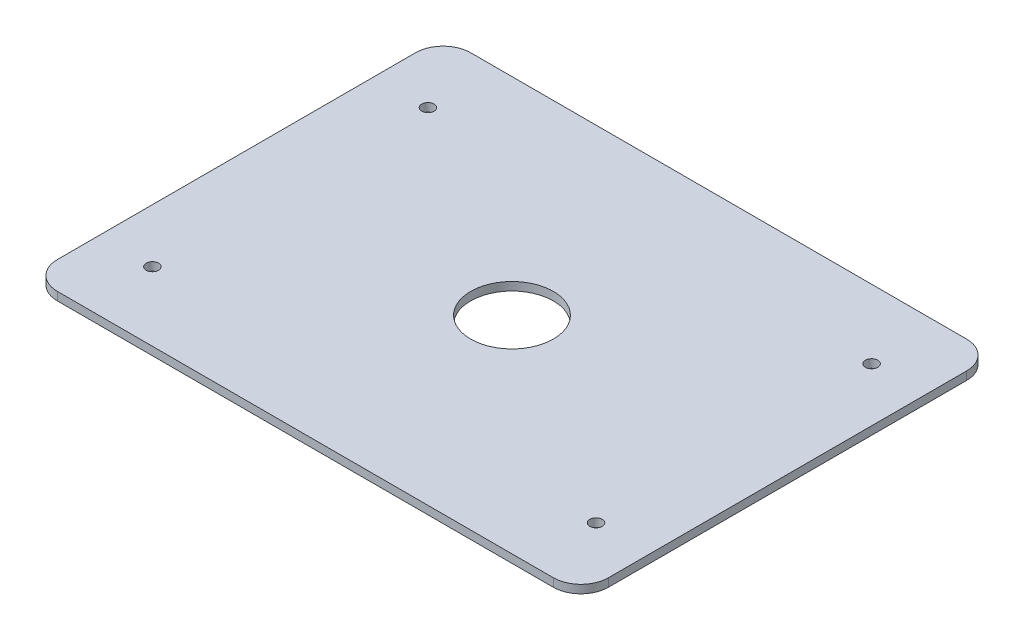
ISO-10303-21;
HEADER;
FILE_DESCRIPTION(('STEP AP214'),'2;1');
FILE_NAME('part.step','',(''),(''),'','','');
FILE_SCHEMA(('AUTOMOTIVE_DESIGN { 1 0 10303 214 1 1 1 1 }'));
ENDSEC;
DATA;
#1=APPLICATION_CONTEXT('core data for automotive mechanical design processes');
#2=APPLICATION_PROTOCOL_DEFINITION('international standard','automotive_design',2000,#1);
#3=PRODUCT_CONTEXT('',#1,'mechanical');
#4=PRODUCT('Part','Part','',(#3));
#5=PRODUCT_RELATED_PRODUCT_CATEGORY('part','',(#4));
#6=PRODUCT_DEFINITION_FORMATION('','',#4);
#7=PRODUCT_DEFINITION_CONTEXT('part definition',#1,'design');
#8=PRODUCT_DEFINITION('design','',#6,#7);
#9=PRODUCT_DEFINITION_SHAPE('','',#8);
#10=(LENGTH_UNIT() NAMED_UNIT(*) SI_UNIT(.MILLI.,.METRE.));
#11=(NAMED_UNIT(*) PLANE_ANGLE_UNIT() SI_UNIT($,.RADIAN.));
#12=(NAMED_UNIT(*) SI_UNIT($,.STERADIAN.) SOLID_ANGLE_UNIT());
#13=UNCERTAINTY_MEASURE_WITH_UNIT(LENGTH_MEASURE(1.E-05),#10,'distance_accuracy_value','');
#14=(GEOMETRIC_REPRESENTATION_CONTEXT(3) GLOBAL_UNCERTAINTY_ASSIGNED_CONTEXT((#13)) GLOBAL_UNIT_ASSIGNED_CONTEXT((#10,
#11,#12)) REPRESENTATION_CONTEXT('',''));
#15=CARTESIAN_POINT('',(0.,0.,0.));
#16=DIRECTION('',(0.,0.,1.));
#17=DIRECTION('',(1.,0.,0.));
#18=AXIS2_PLACEMENT_3D('',#15,#16,#17);
#19=CARTESIAN_POINT('',(145.2,3.,0.));
#20=DIRECTION('',(1.,0.,0.));
#21=DIRECTION('',(0.,0.,-1.));
#22=AXIS2_PLACEMENT_3D('',#19,#20,#21);
#23=PLANE('',#22);
#24=DIRECTION('',(0.,0.,1.));
#25=VECTOR('',#24,1.);
#26=CARTESIAN_POINT('',(145.2,0.,0.));
#27=LINE('',#26,#25);
#28=CARTESIAN_POINT('',(145.2,0.,70.43));
#29=VERTEX_POINT('',#28);
#30=CARTESIAN_POINT('',(145.2,0.,200.43));
#31=VERTEX_POINT('',#30);
#32=EDGE_CURVE('E129',#29,#31,#27,.T.);
#33=ORIENTED_EDGE('',*,*,#32,.F.);
#34=DIRECTION('',(0.,-1.,0.));
#35=VECTOR('',#34,1.);
#36=CARTESIAN_POINT('',(145.2,3.,70.43));
#37=LINE('',#36,#35);
#38=CARTESIAN_POINT('',(145.2,3.,70.43));
#39=VERTEX_POINT('',#38);
#40=EDGE_CURVE('E152',#29,#39,#37,.F.);
#41=ORIENTED_EDGE('',*,*,#40,.T.);
#42=DIRECTION('',(0.,0.,1.));
#43=VECTOR('',#42,1.);
#44=CARTESIAN_POINT('',(145.2,3.,0.));
#45=LINE('',#44,#43);
#46=CARTESIAN_POINT('',(145.2,3.,200.43));
#47=VERTEX_POINT('',#46);
#48=EDGE_CURVE('E167',#39,#47,#45,.T.);
#49=ORIENTED_EDGE('',*,*,#48,.T.);
#50=DIRECTION('',(0.,-1.,0.));
#51=VECTOR('',#50,1.);
#52=CARTESIAN_POINT('',(145.2,0.,200.43));
#53=LINE('',#52,#51);
#54=EDGE_CURVE('E149',#47,#31,#53,.T.);
#55=ORIENTED_EDGE('',*,*,#54,.T.);
#56=EDGE_LOOP('',(#33,#41,#49,#55));
#57=FACE_BOUND('',#56,.T.);
#58=ADVANCED_FACE('F34',(#57),#23,.T.);
#59=CARTESIAN_POINT('',(0.,3.,60.43));
#60=DIRECTION('',(0.,0.,-1.));
#61=DIRECTION('',(-1.,0.,0.));
#62=AXIS2_PLACEMENT_3D('',#59,#60,#61);
#63=PLANE('',#62);
#64=DIRECTION('',(1.,0.,0.));
#65=VECTOR('',#64,1.);
#66=CARTESIAN_POINT('',(0.,0.,60.43));
#67=LINE('',#66,#65);
#68=CARTESIAN_POINT('',(-44.8,0.,60.43));
#69=VERTEX_POINT('',#68);
#70=CARTESIAN_POINT('',(135.2,0.,60.43));
#71=VERTEX_POINT('',#70);
#72=EDGE_CURVE('E125',#69,#71,#67,.T.);
#73=ORIENTED_EDGE('',*,*,#72,.F.);
#74=DIRECTION('',(0.,-1.,0.));
#75=VECTOR('',#74,1.);
#76=CARTESIAN_POINT('',(-44.8,3.,60.43));
#77=LINE('',#76,#75);
#78=CARTESIAN_POINT('',(-44.8,3.,60.43));
#79=VERTEX_POINT('',#78);
#80=EDGE_CURVE('E104',#69,#79,#77,.F.);
#81=ORIENTED_EDGE('',*,*,#80,.T.);
#82=DIRECTION('',(1.,0.,0.));
#83=VECTOR('',#82,1.);
#84=CARTESIAN_POINT('',(0.,3.,60.43));
#85=LINE('',#84,#83);
#86=CARTESIAN_POINT('',(135.2,3.,60.43));
#87=VERTEX_POINT('',#86);
#88=EDGE_CURVE('E169',#79,#87,#85,.T.);
#89=ORIENTED_EDGE('',*,*,#88,.T.);
#90=DIRECTION('',(0.,-1.,0.));
#91=VECTOR('',#90,1.);
#92=CARTESIAN_POINT('',(135.2,3.,60.43));
#93=LINE('',#92,#91);
#94=EDGE_CURVE('E109',#87,#71,#93,.T.);
#95=ORIENTED_EDGE('',*,*,#94,.T.);
#96=EDGE_LOOP('',(#73,#81,#89,#95));
#97=FACE_BOUND('',#96,.T.);
#98=ADVANCED_FACE('F210',(#97),#63,.T.);
#99=CARTESIAN_POINT('',(-54.8,3.,0.));
#100=DIRECTION('',(1.,0.,0.));
#101=DIRECTION('',(0.,0.,-1.));
#102=AXIS2_PLACEMENT_3D('',#99,#100,#101);
#103=PLANE('',#102);
#104=DIRECTION('',(0.,0.,1.));
#105=VECTOR('',#104,1.);
#106=CARTESIAN_POINT('',(-54.8,3.,0.));
#107=LINE('',#106,#105);
#108=CARTESIAN_POINT('',(-54.8,3.,70.43));
#109=VERTEX_POINT('',#108);
#110=CARTESIAN_POINT('',(-54.8,3.,200.43));
#111=VERTEX_POINT('',#110);
#112=EDGE_CURVE('E118',#109,#111,#107,.T.);
#113=ORIENTED_EDGE('',*,*,#112,.F.);
#114=DIRECTION('',(0.,-1.,0.));
#115=VECTOR('',#114,1.);
#116=CARTESIAN_POINT('',(-54.8,0.,70.43));
#117=LINE('',#116,#115);
#118=CARTESIAN_POINT('',(-54.8,0.,70.43));
#119=VERTEX_POINT('',#118);
#120=EDGE_CURVE('E103',#109,#119,#117,.T.);
#121=ORIENTED_EDGE('',*,*,#120,.T.);
#122=DIRECTION('',(0.,0.,1.));
#123=VECTOR('',#122,1.);
#124=CARTESIAN_POINT('',(-54.8,0.,0.));
#125=LINE('',#124,#123);
#126=CARTESIAN_POINT('',(-54.8,0.,200.43));
#127=VERTEX_POINT('',#126);
#128=EDGE_CURVE('E116',#119,#127,#125,.T.);
#129=ORIENTED_EDGE('',*,*,#128,.T.);
#130=DIRECTION('',(0.,-1.,0.));
#131=VECTOR('',#130,1.);
#132=CARTESIAN_POINT('',(-54.8,3.,200.43));
#133=LINE('',#132,#131);
#134=EDGE_CURVE('E120',#127,#111,#133,.F.);
#135=ORIENTED_EDGE('',*,*,#134,.T.);
#136=EDGE_LOOP('',(#113,#121,#129,#135));
#137=FACE_BOUND('',#136,.T.);
#138=ADVANCED_FACE('F115',(#137),#103,.F.);
#139=CARTESIAN_POINT('',(-35.3,3.,85.43));
#140=DIRECTION('',(0.,-1.,0.));
#141=DIRECTION('',(0.,0.,-1.));
#142=AXIS2_PLACEMENT_3D('',#139,#140,#141);
#143=CYLINDRICAL_SURFACE('',#142,2.25);
#144=CARTESIAN_POINT('',(-35.3,3.,85.43));
#145=DIRECTION('',(0.,1.,0.));
#146=DIRECTION('',(0.,0.,1.));
#147=AXIS2_PLACEMENT_3D('',#144,#145,#146);
#148=CIRCLE('',#147,2.25);
#149=CARTESIAN_POINT('',(-35.3,3.,87.68));
#150=VERTEX_POINT('',#149);
#151=EDGE_CURVE('E170',#150,#150,#148,.T.);
#152=ORIENTED_EDGE('',*,*,#151,.T.);
#153=EDGE_LOOP('',(#152));
#154=FACE_BOUND('',#153,.T.);
#155=CARTESIAN_POINT('',(-35.3,0.,85.43));
#156=DIRECTION('',(0.,1.,0.));
#157=DIRECTION('',(0.,0.,1.));
#158=AXIS2_PLACEMENT_3D('',#155,#156,#157);
#159=CIRCLE('',#158,2.25);
#160=CARTESIAN_POINT('',(-35.3,0.,87.68));
#161=VERTEX_POINT('',#160);
#162=EDGE_CURVE('E193',#161,#161,#159,.T.);
#163=ORIENTED_EDGE('',*,*,#162,.F.);
#164=EDGE_LOOP('',(#163));
#165=FACE_BOUND('',#164,.T.);
#166=ADVANCED_FACE('F198',(#154,#165),#143,.F.);
#167=CARTESIAN_POINT('',(125.7,3.,85.43));
#168=DIRECTION('',(0.,-1.,0.));
#169=DIRECTION('',(0.,0.,-1.));
#170=AXIS2_PLACEMENT_3D('',#167,#168,#169);
#171=CYLINDRICAL_SURFACE('',#170,2.25000000000001);
#172=CARTESIAN_POINT('',(125.7,3.,85.43));
#173=DIRECTION('',(0.,1.,0.));
#174=DIRECTION('',(0.,0.,1.));
#175=AXIS2_PLACEMENT_3D('',#172,#173,#174);
#176=CIRCLE('',#175,2.25000000000001);
#177=CARTESIAN_POINT('',(125.7,3.,87.68));
#178=VERTEX_POINT('',#177);
#179=EDGE_CURVE('E175',#178,#178,#176,.T.);
#180=ORIENTED_EDGE('',*,*,#179,.T.);
#181=EDGE_LOOP('',(#180));
#182=FACE_BOUND('',#181,.T.);
#183=CARTESIAN_POINT('',(125.7,0.,85.43));
#184=DIRECTION('',(0.,1.,0.));
#185=DIRECTION('',(0.,0.,1.));
#186=AXIS2_PLACEMENT_3D('',#183,#184,#185);
#187=CIRCLE('',#186,2.25000000000001);
#188=CARTESIAN_POINT('',(125.7,0.,87.68));
#189=VERTEX_POINT('',#188);
#190=EDGE_CURVE('E190',#189,#189,#187,.T.);
#191=ORIENTED_EDGE('',*,*,#190,.F.);
#192=EDGE_LOOP('',(#191));
#193=FACE_BOUND('',#192,.T.);
#194=ADVANCED_FACE('F200',(#182,#193),#171,.F.);
#195=CARTESIAN_POINT('',(125.7,3.,185.43));
#196=DIRECTION('',(0.,-1.,0.));
#197=DIRECTION('',(0.,0.,-1.));
#198=AXIS2_PLACEMENT_3D('',#195,#196,#197);
#199=CYLINDRICAL_SURFACE('',#198,2.25000000000001);
#200=CARTESIAN_POINT('',(125.7,3.,185.43));
#201=DIRECTION('',(0.,1.,0.));
#202=DIRECTION('',(0.,0.,1.));
#203=AXIS2_PLACEMENT_3D('',#200,#201,#202);
#204=CIRCLE('',#203,2.25000000000001);
#205=CARTESIAN_POINT('',(125.7,3.,187.68));
#206=VERTEX_POINT('',#205);
#207=EDGE_CURVE('E241',#206,#206,#204,.T.);
#208=ORIENTED_EDGE('',*,*,#207,.T.);
#209=EDGE_LOOP('',(#208));
#210=FACE_BOUND('',#209,.T.);
#211=CARTESIAN_POINT('',(125.7,0.,185.43));
#212=DIRECTION('',(0.,1.,0.));
#213=DIRECTION('',(0.,0.,1.));
#214=AXIS2_PLACEMENT_3D('',#211,#212,#213);
#215=CIRCLE('',#214,2.25000000000001);
#216=CARTESIAN_POINT('',(125.7,0.,187.68));
#217=VERTEX_POINT('',#216);
#218=EDGE_CURVE('E187',#217,#217,#215,.T.);
#219=ORIENTED_EDGE('',*,*,#218,.F.);
#220=EDGE_LOOP('',(#219));
#221=FACE_BOUND('',#220,.T.);
#222=ADVANCED_FACE('F207',(#210,#221),#199,.F.);
#223=CARTESIAN_POINT('',(-35.2999999999999,3.,185.43));
#224=DIRECTION('',(0.,-1.,0.));
#225=DIRECTION('',(0.,0.,-1.));
#226=AXIS2_PLACEMENT_3D('',#223,#224,#225);
#227=CYLINDRICAL_SURFACE('',#226,2.25);
#228=CARTESIAN_POINT('',(-35.2999999999999,3.,185.43));
#229=DIRECTION('',(0.,1.,0.));
#230=DIRECTION('',(0.,0.,1.));
#231=AXIS2_PLACEMENT_3D('',#228,#229,#230);
#232=CIRCLE('',#231,2.25);
#233=CARTESIAN_POINT('',(-35.2999999999999,3.,187.68));
#234=VERTEX_POINT('',#233);
#235=EDGE_CURVE('E237',#234,#234,#232,.T.);
#236=ORIENTED_EDGE('',*,*,#235,.T.);
#237=EDGE_LOOP('',(#236));
#238=FACE_BOUND('',#237,.T.);
#239=CARTESIAN_POINT('',(-35.2999999999999,0.,185.43));
#240=DIRECTION('',(0.,1.,0.));
#241=DIRECTION('',(0.,0.,1.));
#242=AXIS2_PLACEMENT_3D('',#239,#240,#241);
#243=CIRCLE('',#242,2.25);
#244=CARTESIAN_POINT('',(-35.2999999999999,0.,187.68));
#245=VERTEX_POINT('',#244);
#246=EDGE_CURVE('E184',#245,#245,#243,.T.);
#247=ORIENTED_EDGE('',*,*,#246,.F.);
#248=EDGE_LOOP('',(#247));
#249=FACE_BOUND('',#248,.T.);
#250=ADVANCED_FACE('F260',(#238,#249),#227,.F.);
#251=CARTESIAN_POINT('',(45.2,3.,135.43));
#252=DIRECTION('',(0.,-1.,0.));
#253=DIRECTION('',(0.,0.,-1.));
#254=AXIS2_PLACEMENT_3D('',#251,#252,#253);
#255=CYLINDRICAL_SURFACE('',#254,15.);
#256=CARTESIAN_POINT('',(45.2,3.,135.43));
#257=DIRECTION('',(0.,1.,0.));
#258=DIRECTION('',(0.,0.,1.));
#259=AXIS2_PLACEMENT_3D('',#256,#257,#258);
#260=CIRCLE('',#259,15.);
#261=CARTESIAN_POINT('',(45.2,3.,150.43));
#262=VERTEX_POINT('',#261);
#263=EDGE_CURVE('E127',#262,#262,#260,.T.);
#264=ORIENTED_EDGE('',*,*,#263,.T.);
#265=EDGE_LOOP('',(#264));
#266=FACE_BOUND('',#265,.T.);
#267=CARTESIAN_POINT('',(45.2,0.,135.43));
#268=DIRECTION('',(0.,1.,0.));
#269=DIRECTION('',(0.,0.,1.));
#270=AXIS2_PLACEMENT_3D('',#267,#268,#269);
#271=CIRCLE('',#270,15.);
#272=CARTESIAN_POINT('',(45.2,0.,150.43));
#273=VERTEX_POINT('',#272);
#274=EDGE_CURVE('E181',#273,#273,#271,.T.);
#275=ORIENTED_EDGE('',*,*,#274,.F.);
#276=EDGE_LOOP('',(#275));
#277=FACE_BOUND('',#276,.T.);
#278=ADVANCED_FACE('F223',(#266,#277),#255,.F.);
#279=CARTESIAN_POINT('',(0.,3.,210.43));
#280=DIRECTION('',(0.,0.,-1.));
#281=DIRECTION('',(-1.,0.,0.));
#282=AXIS2_PLACEMENT_3D('',#279,#280,#281);
#283=PLANE('',#282);
#284=DIRECTION('',(1.,0.,0.));
#285=VECTOR('',#284,1.);
#286=CARTESIAN_POINT('',(0.,0.,210.43));
#287=LINE('',#286,#285);
#288=CARTESIAN_POINT('',(-44.8,0.,210.43));
#289=VERTEX_POINT('',#288);
#290=CARTESIAN_POINT('',(135.2,0.,210.43));
#291=VERTEX_POINT('',#290);
#292=EDGE_CURVE('E124',#289,#291,#287,.T.);
#293=ORIENTED_EDGE('',*,*,#292,.T.);
#294=DIRECTION('',(0.,-1.,0.));
#295=VECTOR('',#294,1.);
#296=CARTESIAN_POINT('',(135.2,3.,210.43));
#297=LINE('',#296,#295);
#298=CARTESIAN_POINT('',(135.2,3.,210.43));
#299=VERTEX_POINT('',#298);
#300=EDGE_CURVE('E11',#291,#299,#297,.F.);
#301=ORIENTED_EDGE('',*,*,#300,.T.);
#302=DIRECTION('',(1.,0.,0.));
#303=VECTOR('',#302,1.);
#304=CARTESIAN_POINT('',(0.,3.,210.43));
#305=LINE('',#304,#303);
#306=CARTESIAN_POINT('',(-44.8,3.,210.43));
#307=VERTEX_POINT('',#306);
#308=EDGE_CURVE('E133',#307,#299,#305,.T.);
#309=ORIENTED_EDGE('',*,*,#308,.F.);
#310=DIRECTION('',(0.,-1.,0.));
#311=VECTOR('',#310,1.);
#312=CARTESIAN_POINT('',(-44.8,3.,210.43));
#313=LINE('',#312,#311);
#314=EDGE_CURVE('E42',#307,#289,#313,.T.);
#315=ORIENTED_EDGE('',*,*,#314,.T.);
#316=EDGE_LOOP('',(#293,#301,#309,#315));
#317=FACE_BOUND('',#316,.T.);
#318=ADVANCED_FACE('F155',(#317),#283,.F.);
#319=CARTESIAN_POINT('',(0.,3.,0.));
#320=DIRECTION('',(0.,1.,0.));
#321=DIRECTION('',(0.,0.,1.));
#322=AXIS2_PLACEMENT_3D('',#319,#320,#321);
#323=PLANE('',#322);
#324=ORIENTED_EDGE('',*,*,#263,.F.);
#325=EDGE_LOOP('',(#324));
#326=FACE_BOUND('',#325,.T.);
#327=ORIENTED_EDGE('',*,*,#235,.F.);
#328=EDGE_LOOP('',(#327));
#329=FACE_BOUND('',#328,.T.);
#330=ORIENTED_EDGE('',*,*,#207,.F.);
#331=EDGE_LOOP('',(#330));
#332=FACE_BOUND('',#331,.T.);
#333=ORIENTED_EDGE('',*,*,#179,.F.);
#334=EDGE_LOOP('',(#333));
#335=FACE_BOUND('',#334,.T.);
#336=ORIENTED_EDGE('',*,*,#151,.F.);
#337=EDGE_LOOP('',(#336));
#338=FACE_BOUND('',#337,.T.);
#339=ORIENTED_EDGE('',*,*,#88,.F.);
#340=CARTESIAN_POINT('',(-44.8,3.,70.43));
#341=DIRECTION('',(0.,1.,0.));
#342=DIRECTION('',(0.,0.,1.));
#343=AXIS2_PLACEMENT_3D('',#340,#341,#342);
#344=CIRCLE('',#343,10.);
#345=EDGE_CURVE('E147',#79,#109,#344,.T.);
#346=ORIENTED_EDGE('',*,*,#345,.T.);
#347=ORIENTED_EDGE('',*,*,#112,.T.);
#348=CARTESIAN_POINT('',(-44.8,3.,200.43));
#349=DIRECTION('',(0.,1.,0.));
#350=DIRECTION('',(0.,0.,1.));
#351=AXIS2_PLACEMENT_3D('',#348,#349,#350);
#352=CIRCLE('',#351,10.);
#353=EDGE_CURVE('E54',#111,#307,#352,.T.);
#354=ORIENTED_EDGE('',*,*,#353,.T.);
#355=ORIENTED_EDGE('',*,*,#308,.T.);
#356=CARTESIAN_POINT('',(135.2,3.,200.43));
#357=DIRECTION('',(0.,1.,0.));
#358=DIRECTION('',(0.,0.,1.));
#359=AXIS2_PLACEMENT_3D('',#356,#357,#358);
#360=CIRCLE('',#359,10.);
#361=EDGE_CURVE('E143',#299,#47,#360,.T.);
#362=ORIENTED_EDGE('',*,*,#361,.T.);
#363=ORIENTED_EDGE('',*,*,#48,.F.);
#364=CARTESIAN_POINT('',(135.2,3.,70.43));
#365=DIRECTION('',(0.,1.,0.));
#366=DIRECTION('',(0.,0.,1.));
#367=AXIS2_PLACEMENT_3D('',#364,#365,#366);
#368=CIRCLE('',#367,10.);
#369=EDGE_CURVE('E145',#39,#87,#368,.T.);
#370=ORIENTED_EDGE('',*,*,#369,.T.);
#371=EDGE_LOOP('',(#339,#346,#347,#354,#355,#362,#363,#370));
#372=FACE_BOUND('',#371,.T.);
#373=ADVANCED_FACE('F222',(#326,#329,#332,#335,#338,#372),#323,.T.);
#374=CARTESIAN_POINT('',(0.,0.,0.));
#375=DIRECTION('',(0.,1.,0.));
#376=DIRECTION('',(0.,0.,1.));
#377=AXIS2_PLACEMENT_3D('',#374,#375,#376);
#378=PLANE('',#377);
#379=ORIENTED_EDGE('',*,*,#274,.T.);
#380=EDGE_LOOP('',(#379));
#381=FACE_BOUND('',#380,.T.);
#382=ORIENTED_EDGE('',*,*,#246,.T.);
#383=EDGE_LOOP('',(#382));
#384=FACE_BOUND('',#383,.T.);
#385=ORIENTED_EDGE('',*,*,#218,.T.);
#386=EDGE_LOOP('',(#385));
#387=FACE_BOUND('',#386,.T.);
#388=ORIENTED_EDGE('',*,*,#190,.T.);
#389=EDGE_LOOP('',(#388));
#390=FACE_BOUND('',#389,.T.);
#391=ORIENTED_EDGE('',*,*,#162,.T.);
#392=EDGE_LOOP('',(#391));
#393=FACE_BOUND('',#392,.T.);
#394=ORIENTED_EDGE('',*,*,#128,.F.);
#395=CARTESIAN_POINT('',(-44.8,0.,70.43));
#396=DIRECTION('',(0.,1.,0.));
#397=DIRECTION('',(0.,0.,1.));
#398=AXIS2_PLACEMENT_3D('',#395,#396,#397);
#399=CIRCLE('',#398,10.);
#400=EDGE_CURVE('E99',#119,#69,#399,.F.);
#401=ORIENTED_EDGE('',*,*,#400,.T.);
#402=ORIENTED_EDGE('',*,*,#72,.T.);
#403=CARTESIAN_POINT('',(135.2,0.,70.43));
#404=DIRECTION('',(0.,1.,0.));
#405=DIRECTION('',(0.,0.,1.));
#406=AXIS2_PLACEMENT_3D('',#403,#404,#405);
#407=CIRCLE('',#406,10.);
#408=EDGE_CURVE('E110',#71,#29,#407,.F.);
#409=ORIENTED_EDGE('',*,*,#408,.T.);
#410=ORIENTED_EDGE('',*,*,#32,.T.);
#411=CARTESIAN_POINT('',(135.2,0.,200.43));
#412=DIRECTION('',(0.,1.,0.));
#413=DIRECTION('',(0.,0.,1.));
#414=AXIS2_PLACEMENT_3D('',#411,#412,#413);
#415=CIRCLE('',#414,10.);
#416=EDGE_CURVE('E136',#31,#291,#415,.F.);
#417=ORIENTED_EDGE('',*,*,#416,.T.);
#418=ORIENTED_EDGE('',*,*,#292,.F.);
#419=CARTESIAN_POINT('',(-44.8,0.,200.43));
#420=DIRECTION('',(0.,1.,0.));
#421=DIRECTION('',(0.,0.,1.));
#422=AXIS2_PLACEMENT_3D('',#419,#420,#421);
#423=CIRCLE('',#422,10.);
#424=EDGE_CURVE('E119',#289,#127,#423,.F.);
#425=ORIENTED_EDGE('',*,*,#424,.T.);
#426=EDGE_LOOP('',(#394,#401,#402,#409,#410,#417,#418,#425));
#427=FACE_BOUND('',#426,.T.);
#428=ADVANCED_FACE('F122',(#381,#384,#387,#390,#393,#427),#378,.F.);
#429=CARTESIAN_POINT('',(-44.8,3.,70.43));
#430=DIRECTION('',(0.,1.,0.));
#431=DIRECTION('',(0.,0.,1.));
#432=AXIS2_PLACEMENT_3D('',#429,#430,#431);
#433=CYLINDRICAL_SURFACE('',#432,10.);
#434=ORIENTED_EDGE('',*,*,#345,.F.);
#435=ORIENTED_EDGE('',*,*,#80,.F.);
#436=ORIENTED_EDGE('',*,*,#400,.F.);
#437=ORIENTED_EDGE('',*,*,#120,.F.);
#438=EDGE_LOOP('',(#434,#435,#436,#437));
#439=FACE_BOUND('',#438,.T.);
#440=ADVANCED_FACE('F102',(#439),#433,.T.);
#441=CARTESIAN_POINT('',(135.2,3.,70.43));
#442=DIRECTION('',(0.,-1.,0.));
#443=DIRECTION('',(0.,0.,-1.));
#444=AXIS2_PLACEMENT_3D('',#441,#442,#443);
#445=CYLINDRICAL_SURFACE('',#444,10.);
#446=ORIENTED_EDGE('',*,*,#369,.F.);
#447=ORIENTED_EDGE('',*,*,#40,.F.);
#448=ORIENTED_EDGE('',*,*,#408,.F.);
#449=ORIENTED_EDGE('',*,*,#94,.F.);
#450=EDGE_LOOP('',(#446,#447,#448,#449));
#451=FACE_BOUND('',#450,.T.);
#452=ADVANCED_FACE('F249',(#451),#445,.T.);
#453=CARTESIAN_POINT('',(135.2,3.,200.43));
#454=DIRECTION('',(0.,1.,0.));
#455=DIRECTION('',(0.,0.,1.));
#456=AXIS2_PLACEMENT_3D('',#453,#454,#455);
#457=CYLINDRICAL_SURFACE('',#456,10.);
#458=ORIENTED_EDGE('',*,*,#361,.F.);
#459=ORIENTED_EDGE('',*,*,#300,.F.);
#460=ORIENTED_EDGE('',*,*,#416,.F.);
#461=ORIENTED_EDGE('',*,*,#54,.F.);
#462=EDGE_LOOP('',(#458,#459,#460,#461));
#463=FACE_BOUND('',#462,.T.);
#464=ADVANCED_FACE('F162',(#463),#457,.T.);
#465=CARTESIAN_POINT('',(-44.8,3.,200.43));
#466=DIRECTION('',(0.,-1.,0.));
#467=DIRECTION('',(0.,0.,-1.));
#468=AXIS2_PLACEMENT_3D('',#465,#466,#467);
#469=CYLINDRICAL_SURFACE('',#468,10.);
#470=ORIENTED_EDGE('',*,*,#353,.F.);
#471=ORIENTED_EDGE('',*,*,#134,.F.);
#472=ORIENTED_EDGE('',*,*,#424,.F.);
#473=ORIENTED_EDGE('',*,*,#314,.F.);
#474=EDGE_LOOP('',(#470,#471,#472,#473));
#475=FACE_BOUND('',#474,.T.);
#476=ADVANCED_FACE('F36',(#475),#469,.T.);
#477=CLOSED_SHELL('',(#58,#98,#138,#166,#194,#222,#250,#278,#318,#373,#428,#440,#452,#464,#476));
#478=MANIFOLD_SOLID_BREP('B2',#477);
#479=ADVANCED_BREP_SHAPE_REPRESENTATION('',(#18,#478),#14);
#480=SHAPE_DEFINITION_REPRESENTATION(#9,#479);
ENDSEC;
END-ISO-10303-21;
